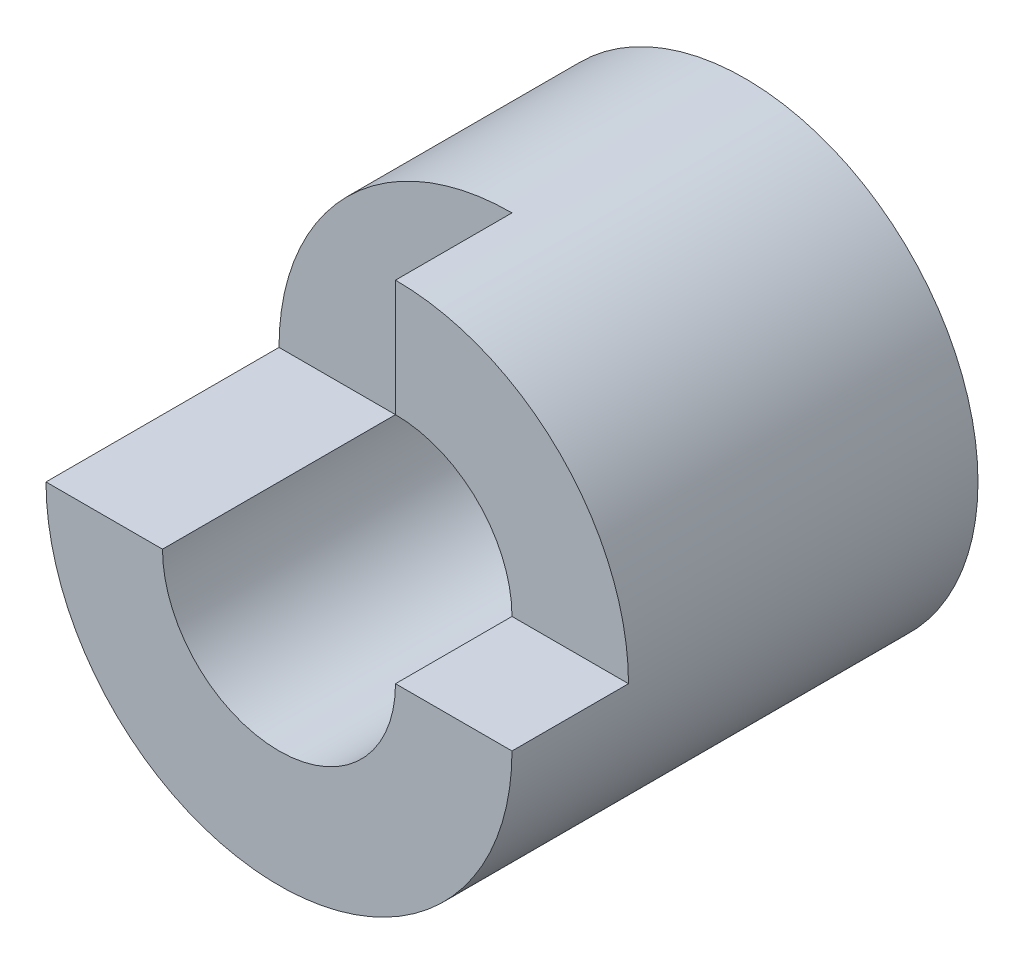
ISO-10303-21;
HEADER;
FILE_DESCRIPTION(('STEP AP214'),'2;1');
FILE_NAME('part.step','',(''),(''),'','','');
FILE_SCHEMA(('AUTOMOTIVE_DESIGN { 1 0 10303 214 1 1 1 1 }'));
ENDSEC;
DATA;
#1=APPLICATION_CONTEXT('core data for automotive mechanical design processes');
#2=APPLICATION_PROTOCOL_DEFINITION('international standard','automotive_design',2000,#1);
#3=PRODUCT_CONTEXT('',#1,'mechanical');
#4=PRODUCT('Part','Part','',(#3));
#5=PRODUCT_RELATED_PRODUCT_CATEGORY('part','',(#4));
#6=PRODUCT_DEFINITION_FORMATION('','',#4);
#7=PRODUCT_DEFINITION_CONTEXT('part definition',#1,'design');
#8=PRODUCT_DEFINITION('design','',#6,#7);
#9=PRODUCT_DEFINITION_SHAPE('','',#8);
#10=(LENGTH_UNIT() NAMED_UNIT(*) SI_UNIT(.MILLI.,.METRE.));
#11=(NAMED_UNIT(*) PLANE_ANGLE_UNIT() SI_UNIT($,.RADIAN.));
#12=(NAMED_UNIT(*) SI_UNIT($,.STERADIAN.) SOLID_ANGLE_UNIT());
#13=UNCERTAINTY_MEASURE_WITH_UNIT(LENGTH_MEASURE(1.E-05),#10,'distance_accuracy_value','');
#14=(GEOMETRIC_REPRESENTATION_CONTEXT(3) GLOBAL_UNCERTAINTY_ASSIGNED_CONTEXT((#13)) GLOBAL_UNIT_ASSIGNED_CONTEXT((#10,
#11,#12)) REPRESENTATION_CONTEXT('',''));
#15=CARTESIAN_POINT('',(0.,0.,0.));
#16=DIRECTION('',(0.,0.,1.));
#17=DIRECTION('',(1.,0.,0.));
#18=AXIS2_PLACEMENT_3D('',#15,#16,#17);
#19=CARTESIAN_POINT('',(0.,0.,40.));
#20=DIRECTION('',(0.,0.,1.));
#21=DIRECTION('',(1.,0.,0.));
#22=AXIS2_PLACEMENT_3D('',#19,#20,#21);
#23=PLANE('',#22);
#24=DIRECTION('',(-1.,0.,0.));
#25=VECTOR('',#24,1.);
#26=CARTESIAN_POINT('',(0.,0.,40.));
#27=LINE('',#26,#25);
#28=CARTESIAN_POINT('',(20.,0.,40.));
#29=VERTEX_POINT('',#28);
#30=CARTESIAN_POINT('',(10.,0.,40.));
#31=VERTEX_POINT('',#30);
#32=EDGE_CURVE('E135',#29,#31,#27,.T.);
#33=ORIENTED_EDGE('',*,*,#32,.T.);
#34=CARTESIAN_POINT('',(0.,0.,40.));
#35=DIRECTION('',(0.,0.,1.));
#36=DIRECTION('',(1.,0.,0.));
#37=AXIS2_PLACEMENT_3D('',#34,#35,#36);
#38=CIRCLE('',#37,10.);
#39=CARTESIAN_POINT('',(-10.,0.,40.));
#40=VERTEX_POINT('',#39);
#41=EDGE_CURVE('E117',#31,#40,#38,.F.);
#42=ORIENTED_EDGE('',*,*,#41,.T.);
#43=CARTESIAN_POINT('',(-20.,0.,40.));
#44=VERTEX_POINT('',#43);
#45=EDGE_CURVE('E54',#40,#44,#27,.T.);
#46=ORIENTED_EDGE('',*,*,#45,.T.);
#47=CARTESIAN_POINT('',(0.,0.,40.));
#48=DIRECTION('',(0.,0.,1.));
#49=DIRECTION('',(1.,0.,0.));
#50=AXIS2_PLACEMENT_3D('',#47,#48,#49);
#51=CIRCLE('',#50,20.);
#52=EDGE_CURVE('E131',#44,#29,#51,.T.);
#53=ORIENTED_EDGE('',*,*,#52,.T.);
#54=EDGE_LOOP('',(#33,#42,#46,#53));
#55=FACE_BOUND('',#54,.T.);
#56=ADVANCED_FACE('F33',(#55),#23,.T.);
#57=CARTESIAN_POINT('',(0.,0.,0.));
#58=DIRECTION('',(0.,0.,1.));
#59=DIRECTION('',(1.,0.,0.));
#60=AXIS2_PLACEMENT_3D('',#57,#58,#59);
#61=PLANE('',#60);
#62=CARTESIAN_POINT('',(0.,0.,0.));
#63=DIRECTION('',(0.,0.,1.));
#64=DIRECTION('',(1.,0.,0.));
#65=AXIS2_PLACEMENT_3D('',#62,#63,#64);
#66=CIRCLE('',#65,20.);
#67=CARTESIAN_POINT('',(20.,0.,0.));
#68=VERTEX_POINT('',#67);
#69=EDGE_CURVE('E130',#68,#68,#66,.T.);
#70=ORIENTED_EDGE('',*,*,#69,.F.);
#71=EDGE_LOOP('',(#70));
#72=FACE_BOUND('',#71,.T.);
#73=CARTESIAN_POINT('',(0.,0.,0.));
#74=DIRECTION('',(0.,0.,1.));
#75=DIRECTION('',(1.,0.,0.));
#76=AXIS2_PLACEMENT_3D('',#73,#74,#75);
#77=CIRCLE('',#76,10.);
#78=CARTESIAN_POINT('',(10.,0.,0.));
#79=VERTEX_POINT('',#78);
#80=EDGE_CURVE('E119',#79,#79,#77,.F.);
#81=ORIENTED_EDGE('',*,*,#80,.F.);
#82=EDGE_LOOP('',(#81));
#83=FACE_BOUND('',#82,.T.);
#84=ADVANCED_FACE('F160',(#72,#83),#61,.F.);
#85=CARTESIAN_POINT('',(40.,20.,30.));
#86=DIRECTION('',(0.,0.,1.));
#87=DIRECTION('',(0.,-1.,0.));
#88=AXIS2_PLACEMENT_3D('',#85,#86,#87);
#89=PLANE('',#88);
#90=DIRECTION('',(0.,1.,0.));
#91=VECTOR('',#90,1.);
#92=CARTESIAN_POINT('',(0.,10.,30.));
#93=LINE('',#92,#91);
#94=CARTESIAN_POINT('',(0.,10.,30.));
#95=VERTEX_POINT('',#94);
#96=CARTESIAN_POINT('',(0.,20.,30.));
#97=VERTEX_POINT('',#96);
#98=EDGE_CURVE('E104',#95,#97,#93,.T.);
#99=ORIENTED_EDGE('',*,*,#98,.F.);
#100=CARTESIAN_POINT('',(0.,0.,30.));
#101=DIRECTION('',(0.,0.,1.));
#102=DIRECTION('',(0.,-1.,0.));
#103=AXIS2_PLACEMENT_3D('',#100,#101,#102);
#104=CIRCLE('',#103,10.);
#105=CARTESIAN_POINT('',(10.,0.,30.));
#106=VERTEX_POINT('',#105);
#107=EDGE_CURVE('E110',#95,#106,#104,.F.);
#108=ORIENTED_EDGE('',*,*,#107,.T.);
#109=DIRECTION('',(-1.,0.,0.));
#110=VECTOR('',#109,1.);
#111=CARTESIAN_POINT('',(40.,0.,30.));
#112=LINE('',#111,#110);
#113=CARTESIAN_POINT('',(20.,0.,30.));
#114=VERTEX_POINT('',#113);
#115=EDGE_CURVE('E122',#114,#106,#112,.T.);
#116=ORIENTED_EDGE('',*,*,#115,.F.);
#117=CARTESIAN_POINT('',(0.,0.,30.));
#118=DIRECTION('',(0.,0.,1.));
#119=DIRECTION('',(0.,-1.,0.));
#120=AXIS2_PLACEMENT_3D('',#117,#118,#119);
#121=CIRCLE('',#120,20.);
#122=EDGE_CURVE('E138',#114,#97,#121,.T.);
#123=ORIENTED_EDGE('',*,*,#122,.T.);
#124=EDGE_LOOP('',(#99,#108,#116,#123));
#125=FACE_BOUND('',#124,.T.);
#126=ADVANCED_FACE('F142',(#125),#89,.T.);
#127=CARTESIAN_POINT('',(40.,0.,40.));
#128=DIRECTION('',(0.,1.,0.));
#129=DIRECTION('',(0.,0.,1.));
#130=AXIS2_PLACEMENT_3D('',#127,#128,#129);
#131=PLANE('',#130);
#132=ORIENTED_EDGE('',*,*,#115,.T.);
#133=DIRECTION('',(0.,0.,-1.));
#134=VECTOR('',#133,1.);
#135=CARTESIAN_POINT('',(10.,0.,70.));
#136=LINE('',#135,#134);
#137=EDGE_CURVE('E11',#106,#31,#136,.F.);
#138=ORIENTED_EDGE('',*,*,#137,.T.);
#139=ORIENTED_EDGE('',*,*,#32,.F.);
#140=DIRECTION('',(0.,0.,-1.));
#141=VECTOR('',#140,1.);
#142=CARTESIAN_POINT('',(20.,0.,40.));
#143=LINE('',#142,#141);
#144=EDGE_CURVE('E127',#29,#114,#143,.T.);
#145=ORIENTED_EDGE('',*,*,#144,.T.);
#146=EDGE_LOOP('',(#132,#138,#139,#145));
#147=FACE_BOUND('',#146,.T.);
#148=ADVANCED_FACE('F148',(#147),#131,.T.);
#149=ORIENTED_EDGE('',*,*,#45,.F.);
#150=DIRECTION('',(0.,0.,-1.));
#151=VECTOR('',#150,1.);
#152=CARTESIAN_POINT('',(-10.,0.,70.));
#153=LINE('',#152,#151);
#154=CARTESIAN_POINT('',(-10.,0.,20.));
#155=VERTEX_POINT('',#154);
#156=EDGE_CURVE('E41',#40,#155,#153,.T.);
#157=ORIENTED_EDGE('',*,*,#156,.T.);
#158=DIRECTION('',(1.,0.,0.));
#159=VECTOR('',#158,1.);
#160=CARTESIAN_POINT('',(-20.,0.,20.));
#161=LINE('',#160,#159);
#162=CARTESIAN_POINT('',(-20.,0.,20.));
#163=VERTEX_POINT('',#162);
#164=EDGE_CURVE('E102',#163,#155,#161,.T.);
#165=ORIENTED_EDGE('',*,*,#164,.F.);
#166=DIRECTION('',(0.,0.,-1.));
#167=VECTOR('',#166,1.);
#168=CARTESIAN_POINT('',(-20.,0.,40.));
#169=LINE('',#168,#167);
#170=EDGE_CURVE('E125',#163,#44,#169,.F.);
#171=ORIENTED_EDGE('',*,*,#170,.T.);
#172=EDGE_LOOP('',(#149,#157,#165,#171));
#173=FACE_BOUND('',#172,.T.);
#174=ADVANCED_FACE('F150',(#173),#131,.T.);
#175=CARTESIAN_POINT('',(0.,0.,40.));
#176=DIRECTION('',(0.,0.,-1.));
#177=DIRECTION('',(-1.,0.,0.));
#178=AXIS2_PLACEMENT_3D('',#175,#176,#177);
#179=CYLINDRICAL_SURFACE('',#178,20.);
#180=ORIENTED_EDGE('',*,*,#170,.F.);
#181=CARTESIAN_POINT('',(0.,0.,20.));
#182=DIRECTION('',(0.,0.,1.));
#183=DIRECTION('',(1.,0.,0.));
#184=AXIS2_PLACEMENT_3D('',#181,#182,#183);
#185=CIRCLE('',#184,20.);
#186=CARTESIAN_POINT('',(0.,20.,20.));
#187=VERTEX_POINT('',#186);
#188=EDGE_CURVE('E97',#187,#163,#185,.T.);
#189=ORIENTED_EDGE('',*,*,#188,.F.);
#190=DIRECTION('',(0.,0.,1.));
#191=VECTOR('',#190,1.);
#192=CARTESIAN_POINT('',(0.,20.,20.));
#193=LINE('',#192,#191);
#194=EDGE_CURVE('E93',#187,#97,#193,.T.);
#195=ORIENTED_EDGE('',*,*,#194,.T.);
#196=ORIENTED_EDGE('',*,*,#122,.F.);
#197=ORIENTED_EDGE('',*,*,#144,.F.);
#198=ORIENTED_EDGE('',*,*,#52,.F.);
#199=EDGE_LOOP('',(#180,#189,#195,#196,#197,#198));
#200=FACE_BOUND('',#199,.T.);
#201=ORIENTED_EDGE('',*,*,#69,.T.);
#202=EDGE_LOOP('',(#201));
#203=FACE_BOUND('',#202,.T.);
#204=ADVANCED_FACE('F35',(#200,#203),#179,.T.);
#205=CARTESIAN_POINT('',(0.,0.,70.));
#206=DIRECTION('',(0.,0.,-1.));
#207=DIRECTION('',(-1.,0.,0.));
#208=AXIS2_PLACEMENT_3D('',#205,#206,#207);
#209=CYLINDRICAL_SURFACE('',#208,10.);
#210=CARTESIAN_POINT('',(0.,0.,20.));
#211=DIRECTION('',(0.,0.,-1.));
#212=DIRECTION('',(1.,0.,0.));
#213=AXIS2_PLACEMENT_3D('',#210,#211,#212);
#214=CIRCLE('',#213,10.);
#215=CARTESIAN_POINT('',(0.,10.,20.));
#216=VERTEX_POINT('',#215);
#217=EDGE_CURVE('E98',#155,#216,#214,.T.);
#218=ORIENTED_EDGE('',*,*,#217,.F.);
#219=ORIENTED_EDGE('',*,*,#156,.F.);
#220=ORIENTED_EDGE('',*,*,#41,.F.);
#221=ORIENTED_EDGE('',*,*,#137,.F.);
#222=ORIENTED_EDGE('',*,*,#107,.F.);
#223=DIRECTION('',(0.,0.,1.));
#224=VECTOR('',#223,1.);
#225=CARTESIAN_POINT('',(0.,10.,20.));
#226=LINE('',#225,#224);
#227=EDGE_CURVE('E90',#216,#95,#226,.T.);
#228=ORIENTED_EDGE('',*,*,#227,.F.);
#229=EDGE_LOOP('',(#218,#219,#220,#221,#222,#228));
#230=FACE_BOUND('',#229,.T.);
#231=ORIENTED_EDGE('',*,*,#80,.T.);
#232=EDGE_LOOP('',(#231));
#233=FACE_BOUND('',#232,.T.);
#234=ADVANCED_FACE('F107',(#230,#233),#209,.F.);
#235=CARTESIAN_POINT('',(0.,10.,20.));
#236=DIRECTION('',(1.,0.,0.));
#237=DIRECTION('',(0.,1.,0.));
#238=AXIS2_PLACEMENT_3D('',#235,#236,#237);
#239=PLANE('',#238);
#240=ORIENTED_EDGE('',*,*,#98,.T.);
#241=ORIENTED_EDGE('',*,*,#194,.F.);
#242=DIRECTION('',(0.,1.,0.));
#243=VECTOR('',#242,1.);
#244=CARTESIAN_POINT('',(0.,10.,20.));
#245=LINE('',#244,#243);
#246=EDGE_CURVE('E86',#216,#187,#245,.T.);
#247=ORIENTED_EDGE('',*,*,#246,.F.);
#248=ORIENTED_EDGE('',*,*,#227,.T.);
#249=EDGE_LOOP('',(#240,#241,#247,#248));
#250=FACE_BOUND('',#249,.T.);
#251=ADVANCED_FACE('F88',(#250),#239,.F.);
#252=CARTESIAN_POINT('',(0.,0.,20.));
#253=DIRECTION('',(0.,0.,1.));
#254=DIRECTION('',(1.,0.,0.));
#255=AXIS2_PLACEMENT_3D('',#252,#253,#254);
#256=PLANE('',#255);
#257=ORIENTED_EDGE('',*,*,#217,.T.);
#258=ORIENTED_EDGE('',*,*,#246,.T.);
#259=ORIENTED_EDGE('',*,*,#188,.T.);
#260=ORIENTED_EDGE('',*,*,#164,.T.);
#261=EDGE_LOOP('',(#257,#258,#259,#260));
#262=FACE_BOUND('',#261,.T.);
#263=ADVANCED_FACE('F101',(#262),#256,.T.);
#264=CLOSED_SHELL('',(#56,#84,#126,#148,#174,#204,#234,#251,#263));
#265=MANIFOLD_SOLID_BREP('B2',#264);
#266=ADVANCED_BREP_SHAPE_REPRESENTATION('',(#18,#265),#14);
#267=SHAPE_DEFINITION_REPRESENTATION(#9,#266);
ENDSEC;
END-ISO-10303-21;
